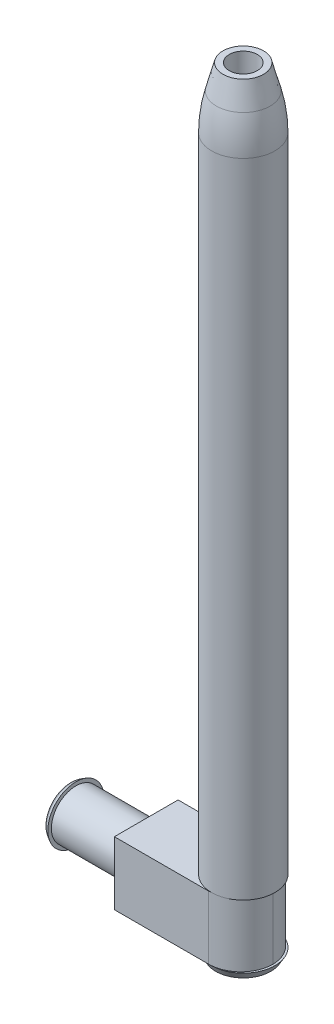
ISO-10303-21;
HEADER;
FILE_DESCRIPTION(('STEP AP214'),'2;1');
FILE_NAME('part.step','',(''),(''),'','','');
FILE_SCHEMA(('AUTOMOTIVE_DESIGN { 1 0 10303 214 1 1 1 1 }'));
ENDSEC;
DATA;
#1=APPLICATION_CONTEXT('core data for automotive mechanical design processes');
#2=APPLICATION_PROTOCOL_DEFINITION('international standard','automotive_design',2000,#1);
#3=PRODUCT_CONTEXT('',#1,'mechanical');
#4=PRODUCT('Part','Part','',(#3));
#5=PRODUCT_RELATED_PRODUCT_CATEGORY('part','',(#4));
#6=PRODUCT_DEFINITION_FORMATION('','',#4);
#7=PRODUCT_DEFINITION_CONTEXT('part definition',#1,'design');
#8=PRODUCT_DEFINITION('design','',#6,#7);
#9=PRODUCT_DEFINITION_SHAPE('','',#8);
#10=(LENGTH_UNIT() NAMED_UNIT(*) SI_UNIT(.MILLI.,.METRE.));
#11=(NAMED_UNIT(*) PLANE_ANGLE_UNIT() SI_UNIT($,.RADIAN.));
#12=(NAMED_UNIT(*) SI_UNIT($,.STERADIAN.) SOLID_ANGLE_UNIT());
#13=UNCERTAINTY_MEASURE_WITH_UNIT(LENGTH_MEASURE(1.E-05),#10,'distance_accuracy_value','');
#14=(GEOMETRIC_REPRESENTATION_CONTEXT(3) GLOBAL_UNCERTAINTY_ASSIGNED_CONTEXT((#13)) GLOBAL_UNIT_ASSIGNED_CONTEXT((#10,
#11,#12)) REPRESENTATION_CONTEXT('',''));
#15=CARTESIAN_POINT('',(0.,0.,0.));
#16=DIRECTION('',(0.,0.,1.));
#17=DIRECTION('',(1.,0.,0.));
#18=AXIS2_PLACEMENT_3D('',#15,#16,#17);
#19=CARTESIAN_POINT('',(29.21,5.715,5.7531));
#20=DIRECTION('',(0.,-1.,0.));
#21=DIRECTION('',(0.,0.,-1.));
#22=AXIS2_PLACEMENT_3D('',#19,#20,#21);
#23=PLANE('',#22);
#24=CARTESIAN_POINT('',(23.876,5.715,0.));
#25=DIRECTION('',(0.,1.,0.));
#26=DIRECTION('',(0.,0.,1.));
#27=AXIS2_PLACEMENT_3D('',#24,#25,#26);
#28=CIRCLE('',#27,5.715);
#29=CARTESIAN_POINT('',(24.0592354385687,5.715,-5.71206177960747));
#30=VERTEX_POINT('',#29);
#31=CARTESIAN_POINT('',(24.0592354385687,5.715,5.71206177960747));
#32=VERTEX_POINT('',#31);
#33=EDGE_CURVE('E49',#30,#32,#28,.T.);
#34=ORIENTED_EDGE('',*,*,#33,.F.);
#35=CARTESIAN_POINT('',(23.368,5.715,0.0889000000000003));
#36=DIRECTION('',(0.,-1.,0.));
#37=DIRECTION('',(0.,0.,-1.));
#38=AXIS2_PLACEMENT_3D('',#35,#36,#37);
#39=CIRCLE('',#38,5.842);
#40=CARTESIAN_POINT('',(23.368,5.715,-5.7531));
#41=VERTEX_POINT('',#40);
#42=EDGE_CURVE('E98',#30,#41,#39,.F.);
#43=ORIENTED_EDGE('',*,*,#42,.T.);
#44=DIRECTION('',(-1.,0.,0.));
#45=VECTOR('',#44,1.);
#46=CARTESIAN_POINT('',(29.21,5.715,-5.7531));
#47=LINE('',#46,#45);
#48=CARTESIAN_POINT('',(6.35,5.715,-5.7531));
#49=VERTEX_POINT('',#48);
#50=EDGE_CURVE('E147',#41,#49,#47,.T.);
#51=ORIENTED_EDGE('',*,*,#50,.T.);
#52=DIRECTION('',(0.,0.,1.));
#53=VECTOR('',#52,1.);
#54=CARTESIAN_POINT('',(6.35,5.715,5.7531));
#55=LINE('',#54,#53);
#56=CARTESIAN_POINT('',(6.35,5.715,5.7531));
#57=VERTEX_POINT('',#56);
#58=EDGE_CURVE('E134',#49,#57,#55,.T.);
#59=ORIENTED_EDGE('',*,*,#58,.T.);
#60=DIRECTION('',(-1.,0.,0.));
#61=VECTOR('',#60,1.);
#62=CARTESIAN_POINT('',(29.21,5.715,5.7531));
#63=LINE('',#62,#61);
#64=CARTESIAN_POINT('',(23.368,5.715,5.7531));
#65=VERTEX_POINT('',#64);
#66=EDGE_CURVE('E95',#65,#57,#63,.T.);
#67=ORIENTED_EDGE('',*,*,#66,.F.);
#68=CARTESIAN_POINT('',(23.368,5.715,-0.0889000000000003));
#69=DIRECTION('',(0.,-1.,0.));
#70=DIRECTION('',(0.,0.,-1.));
#71=AXIS2_PLACEMENT_3D('',#68,#69,#70);
#72=CIRCLE('',#71,5.842);
#73=EDGE_CURVE('E92',#65,#32,#72,.F.);
#74=ORIENTED_EDGE('',*,*,#73,.T.);
#75=EDGE_LOOP('',(#34,#43,#51,#59,#67,#74));
#76=FACE_BOUND('',#75,.T.);
#77=ADVANCED_FACE('F34',(#76),#23,.F.);
#78=CARTESIAN_POINT('',(29.21,-5.715,5.7531));
#79=DIRECTION('',(0.,1.,0.));
#80=DIRECTION('',(0.,0.,1.));
#81=AXIS2_PLACEMENT_3D('',#78,#79,#80);
#82=PLANE('',#81);
#83=CARTESIAN_POINT('',(23.876,-5.715,0.));
#84=DIRECTION('',(0.,-1.,0.));
#85=DIRECTION('',(0.,0.,-1.));
#86=AXIS2_PLACEMENT_3D('',#83,#84,#85);
#87=CIRCLE('',#86,5.715);
#88=CARTESIAN_POINT('',(24.0592354385687,-5.715,5.71206177960747));
#89=VERTEX_POINT('',#88);
#90=CARTESIAN_POINT('',(24.0592354385687,-5.715,-5.71206177960747));
#91=VERTEX_POINT('',#90);
#92=EDGE_CURVE('E57',#89,#91,#87,.T.);
#93=ORIENTED_EDGE('',*,*,#92,.F.);
#94=CARTESIAN_POINT('',(23.368,-5.715,-0.0889000000000003));
#95=DIRECTION('',(0.,1.,0.));
#96=DIRECTION('',(0.,0.,1.));
#97=AXIS2_PLACEMENT_3D('',#94,#95,#96);
#98=CIRCLE('',#97,5.842);
#99=CARTESIAN_POINT('',(23.368,-5.715,5.7531));
#100=VERTEX_POINT('',#99);
#101=EDGE_CURVE('E167',#89,#100,#98,.F.);
#102=ORIENTED_EDGE('',*,*,#101,.T.);
#103=DIRECTION('',(-1.,0.,0.));
#104=VECTOR('',#103,1.);
#105=CARTESIAN_POINT('',(29.21,-5.715,5.7531));
#106=LINE('',#105,#104);
#107=CARTESIAN_POINT('',(6.35,-5.715,5.7531));
#108=VERTEX_POINT('',#107);
#109=EDGE_CURVE('E144',#100,#108,#106,.T.);
#110=ORIENTED_EDGE('',*,*,#109,.T.);
#111=DIRECTION('',(0.,0.,-1.));
#112=VECTOR('',#111,1.);
#113=CARTESIAN_POINT('',(6.35,-5.715,5.7531));
#114=LINE('',#113,#112);
#115=CARTESIAN_POINT('',(6.35,-5.715,-5.7531));
#116=VERTEX_POINT('',#115);
#117=EDGE_CURVE('E139',#108,#116,#114,.T.);
#118=ORIENTED_EDGE('',*,*,#117,.T.);
#119=DIRECTION('',(-1.,0.,0.));
#120=VECTOR('',#119,1.);
#121=CARTESIAN_POINT('',(29.21,-5.715,-5.7531));
#122=LINE('',#121,#120);
#123=CARTESIAN_POINT('',(23.368,-5.715,-5.7531));
#124=VERTEX_POINT('',#123);
#125=EDGE_CURVE('E142',#124,#116,#122,.T.);
#126=ORIENTED_EDGE('',*,*,#125,.F.);
#127=CARTESIAN_POINT('',(23.368,-5.715,0.0889000000000003));
#128=DIRECTION('',(0.,1.,0.));
#129=DIRECTION('',(0.,0.,1.));
#130=AXIS2_PLACEMENT_3D('',#127,#128,#129);
#131=CIRCLE('',#130,5.842);
#132=EDGE_CURVE('E172',#124,#91,#131,.F.);
#133=ORIENTED_EDGE('',*,*,#132,.T.);
#134=EDGE_LOOP('',(#93,#102,#110,#118,#126,#133));
#135=FACE_BOUND('',#134,.T.);
#136=ADVANCED_FACE('F192',(#135),#82,.F.);
#137=CARTESIAN_POINT('',(6.35,0.,0.));
#138=DIRECTION('',(-1.,0.,0.));
#139=DIRECTION('',(0.,0.,1.));
#140=AXIS2_PLACEMENT_3D('',#137,#138,#139);
#141=CYLINDRICAL_SURFACE('',#140,4.445);
#142=CARTESIAN_POINT('',(6.35,0.,0.));
#143=DIRECTION('',(1.,0.,0.));
#144=DIRECTION('',(0.,0.,-1.));
#145=AXIS2_PLACEMENT_3D('',#142,#143,#144);
#146=CIRCLE('',#145,4.445);
#147=CARTESIAN_POINT('',(6.35,0.,4.445));
#148=VERTEX_POINT('',#147);
#149=EDGE_CURVE('E155',#148,#148,#146,.T.);
#150=CARTESIAN_POINT('',(-6.35,0.,0.));
#151=DIRECTION('',(-1.,0.,0.));
#152=DIRECTION('',(0.,0.,1.));
#153=AXIS2_PLACEMENT_3D('',#150,#151,#152);
#154=CIRCLE('',#153,4.445);
#155=CARTESIAN_POINT('',(-6.35,0.,4.445));
#156=VERTEX_POINT('',#155);
#157=EDGE_CURVE('E152',#156,#156,#154,.T.);
#158=CARTESIAN_POINT('',(6.35,0.,4.445));
#159=CARTESIAN_POINT('',(6.21770833333333,0.,4.445));
#160=CARTESIAN_POINT('',(6.08541666666667,0.,4.445));
#161=CARTESIAN_POINT('',(5.82083333333333,0.,4.445));
#162=CARTESIAN_POINT('',(5.68854166666667,0.,4.445));
#163=CARTESIAN_POINT('',(5.42395833333333,0.,4.445));
#164=CARTESIAN_POINT('',(5.29166666666667,0.,4.445));
#165=CARTESIAN_POINT('',(5.02708333333333,0.,4.445));
#166=CARTESIAN_POINT('',(4.89479166666667,0.,4.445));
#167=CARTESIAN_POINT('',(4.63020833333333,0.,4.445));
#168=CARTESIAN_POINT('',(4.49791666666667,0.,4.445));
#169=CARTESIAN_POINT('',(4.23333333333333,0.,4.445));
#170=CARTESIAN_POINT('',(4.10104166666667,0.,4.445));
#171=CARTESIAN_POINT('',(3.83645833333333,0.,4.445));
#172=CARTESIAN_POINT('',(3.70416666666667,0.,4.445));
#173=CARTESIAN_POINT('',(3.43958333333333,0.,4.445));
#174=CARTESIAN_POINT('',(3.30729166666667,0.,4.445));
#175=CARTESIAN_POINT('',(3.04270833333333,0.,4.445));
#176=CARTESIAN_POINT('',(2.91041666666667,0.,4.445));
#177=CARTESIAN_POINT('',(2.64583333333333,0.,4.445));
#178=CARTESIAN_POINT('',(2.51354166666667,0.,4.445));
#179=CARTESIAN_POINT('',(2.24895833333333,0.,4.445));
#180=CARTESIAN_POINT('',(2.11666666666667,0.,4.445));
#181=CARTESIAN_POINT('',(1.85208333333333,0.,4.445));
#182=CARTESIAN_POINT('',(1.71979166666667,0.,4.445));
#183=CARTESIAN_POINT('',(1.45520833333333,0.,4.445));
#184=CARTESIAN_POINT('',(1.32291666666667,0.,4.445));
#185=CARTESIAN_POINT('',(1.05833333333333,0.,4.445));
#186=CARTESIAN_POINT('',(0.926041666666666,0.,4.445));
#187=CARTESIAN_POINT('',(0.661458333333332,0.,4.445));
#188=CARTESIAN_POINT('',(0.529166666666666,0.,4.445));
#189=CARTESIAN_POINT('',(0.264583333333332,0.,4.445));
#190=CARTESIAN_POINT('',(0.132291666666666,0.,4.445));
#191=CARTESIAN_POINT('',(-0.132291666666667,0.,4.445));
#192=CARTESIAN_POINT('',(-0.264583333333334,0.,4.445));
#193=CARTESIAN_POINT('',(-0.529166666666667,0.,4.445));
#194=CARTESIAN_POINT('',(-0.661458333333334,0.,4.445));
#195=CARTESIAN_POINT('',(-0.926041666666668,0.,4.445));
#196=CARTESIAN_POINT('',(-1.05833333333333,0.,4.445));
#197=CARTESIAN_POINT('',(-1.32291666666667,0.,4.445));
#198=CARTESIAN_POINT('',(-1.45520833333333,0.,4.445));
#199=CARTESIAN_POINT('',(-1.71979166666667,0.,4.445));
#200=CARTESIAN_POINT('',(-1.85208333333333,0.,4.445));
#201=CARTESIAN_POINT('',(-2.11666666666667,0.,4.445));
#202=CARTESIAN_POINT('',(-2.24895833333333,0.,4.445));
#203=CARTESIAN_POINT('',(-2.51354166666667,0.,4.445));
#204=CARTESIAN_POINT('',(-2.64583333333333,0.,4.445));
#205=CARTESIAN_POINT('',(-2.91041666666667,0.,4.445));
#206=CARTESIAN_POINT('',(-3.04270833333333,0.,4.445));
#207=CARTESIAN_POINT('',(-3.30729166666667,0.,4.445));
#208=CARTESIAN_POINT('',(-3.43958333333333,0.,4.445));
#209=CARTESIAN_POINT('',(-3.70416666666667,0.,4.445));
#210=CARTESIAN_POINT('',(-3.83645833333333,0.,4.445));
#211=CARTESIAN_POINT('',(-4.10104166666667,0.,4.445));
#212=CARTESIAN_POINT('',(-4.23333333333333,0.,4.445));
#213=CARTESIAN_POINT('',(-4.49791666666667,0.,4.445));
#214=CARTESIAN_POINT('',(-4.63020833333333,0.,4.445));
#215=CARTESIAN_POINT('',(-4.89479166666667,0.,4.445));
#216=CARTESIAN_POINT('',(-5.02708333333333,0.,4.445));
#217=CARTESIAN_POINT('',(-5.29166666666667,0.,4.445));
#218=CARTESIAN_POINT('',(-5.42395833333333,0.,4.445));
#219=CARTESIAN_POINT('',(-5.68854166666667,0.,4.445));
#220=CARTESIAN_POINT('',(-5.82083333333333,0.,4.445));
#221=CARTESIAN_POINT('',(-6.08541666666667,0.,4.445));
#222=CARTESIAN_POINT('',(-6.21770833333333,0.,4.445));
#223=CARTESIAN_POINT('',(-6.35,0.,4.445));
#224=B_SPLINE_CURVE_WITH_KNOTS('',3,(#158,#159,#160,#161,#162,#163,#164,#165,#166,#167,#168,
#169,#170,#171,#172,#173,#174,#175,#176,#177,#178,#179,#180,#181,#182,#183,#184,#185,#186,#187,
#188,#189,#190,#191,#192,#193,#194,#195,#196,#197,#198,#199,#200,#201,#202,#203,#204,#205,#206,
#207,#208,#209,#210,#211,#212,#213,#214,#215,#216,#217,#218,#219,#220,#221,#222,#223),
.UNSPECIFIED.,.F.,.F.,(4,2,2,2,2,2,2,2,2,2,2,2,2,2,2,2,2,2,2,2,2,2,2,2,2,2,2,2,2,2,2,2,4),(0.,
0.396875,0.793749999999999,1.190625,1.5875,1.984375,2.38125,2.778125,3.175,3.571875,3.96875,
4.365625,4.7625,5.159375,5.55625,5.953125,6.35,6.746875,7.14375,7.540625,7.9375,8.334375,
8.73125,9.128125,9.525,9.921875,10.31875,10.715625,11.1125,11.509375,11.90625,12.303125,12.7),.UNSPECIFIED.);
#225=EDGE_CURVE('BSEAM197',#148,#156,#224,.T.);
#226=ORIENTED_EDGE('',*,*,#149,.F.);
#227=ORIENTED_EDGE('',*,*,#157,.F.);
#228=ORIENTED_EDGE('',*,*,#225,.T.);
#229=ORIENTED_EDGE('',*,*,#225,.F.);
#230=EDGE_LOOP('',(#226,#228,#227,#229));
#231=FACE_BOUND('',#230,.T.);
#232=ADVANCED_FACE('F197',(#231),#141,.T.);
#233=CARTESIAN_POINT('',(-6.35,0.,0.));
#234=DIRECTION('',(-1.,0.,0.));
#235=DIRECTION('',(0.,0.,1.));
#236=AXIS2_PLACEMENT_3D('',#233,#234,#235);
#237=PLANE('',#236);
#238=CARTESIAN_POINT('',(-6.35,0.,0.));
#239=DIRECTION('',(-1.,0.,0.));
#240=DIRECTION('',(0.,0.,1.));
#241=AXIS2_PLACEMENT_3D('',#238,#239,#240);
#242=CIRCLE('',#241,5.08);
#243=CARTESIAN_POINT('',(-6.35,0.,5.08));
#244=VERTEX_POINT('',#243);
#245=EDGE_CURVE('E149',#244,#244,#242,.T.);
#246=ORIENTED_EDGE('',*,*,#245,.F.);
#247=EDGE_LOOP('',(#246));
#248=FACE_BOUND('',#247,.T.);
#249=ORIENTED_EDGE('',*,*,#157,.T.);
#250=EDGE_LOOP('',(#249));
#251=FACE_BOUND('',#250,.T.);
#252=ADVANCED_FACE('F213',(#248,#251),#237,.F.);
#253=CARTESIAN_POINT('',(-6.35,0.,0.));
#254=DIRECTION('',(1.,0.,0.));
#255=DIRECTION('',(0.,0.,1.));
#256=AXIS2_PLACEMENT_3D('',#253,#254,#255);
#257=CONICAL_SURFACE('',#256,5.08,0.5235987755983);
#258=CARTESIAN_POINT('',(-6.985,0.,0.));
#259=DIRECTION('',(1.,0.,0.));
#260=DIRECTION('',(0.,0.,-1.));
#261=AXIS2_PLACEMENT_3D('',#258,#259,#260);
#262=CIRCLE('',#261,4.71338257906459);
#263=CARTESIAN_POINT('',(-6.985,0.,-4.71338257906459));
#264=VERTEX_POINT('',#263);
#265=EDGE_CURVE('E109',#264,#264,#262,.T.);
#266=ORIENTED_EDGE('',*,*,#265,.T.);
#267=EDGE_LOOP('',(#266));
#268=FACE_BOUND('',#267,.T.);
#269=ORIENTED_EDGE('',*,*,#245,.T.);
#270=EDGE_LOOP('',(#269));
#271=FACE_BOUND('',#270,.T.);
#272=ADVANCED_FACE('F211',(#268,#271),#257,.T.);
#273=CARTESIAN_POINT('',(-7.62,0.,0.));
#274=DIRECTION('',(-1.,0.,0.));
#275=DIRECTION('',(0.,0.,1.));
#276=AXIS2_PLACEMENT_3D('',#273,#274,#275);
#277=PLANE('',#276);
#278=CARTESIAN_POINT('',(-7.62,0.,0.));
#279=DIRECTION('',(-1.,0.,0.));
#280=DIRECTION('',(0.,0.,1.));
#281=AXIS2_PLACEMENT_3D('',#278,#279,#280);
#282=CIRCLE('',#281,3.61353031625835);
#283=CARTESIAN_POINT('',(-7.62,0.,3.61353031625835));
#284=VERTEX_POINT('',#283);
#285=EDGE_CURVE('E158',#284,#284,#282,.T.);
#286=ORIENTED_EDGE('',*,*,#285,.T.);
#287=EDGE_LOOP('',(#286));
#288=FACE_BOUND('',#287,.T.);
#289=ADVANCED_FACE('F207',(#288),#277,.T.);
#290=CARTESIAN_POINT('',(-6.35,0.,0.));
#291=DIRECTION('',(-1.,0.,0.));
#292=DIRECTION('',(0.,0.,1.));
#293=AXIS2_PLACEMENT_3D('',#290,#291,#292);
#294=TOROIDAL_SURFACE('',#293,3.61353031625835,1.27);
#295=ORIENTED_EDGE('',*,*,#265,.F.);
#296=EDGE_LOOP('',(#295));
#297=FACE_BOUND('',#296,.T.);
#298=ORIENTED_EDGE('',*,*,#285,.F.);
#299=EDGE_LOOP('',(#298));
#300=FACE_BOUND('',#299,.T.);
#301=ADVANCED_FACE('F210',(#297,#300),#294,.T.);
#302=CARTESIAN_POINT('',(6.35,0.,0.));
#303=DIRECTION('',(-1.,0.,0.));
#304=DIRECTION('',(0.,0.,1.));
#305=AXIS2_PLACEMENT_3D('',#302,#303,#304);
#306=PLANE('',#305);
#307=DIRECTION('',(0.,1.,0.));
#308=VECTOR('',#307,1.);
#309=CARTESIAN_POINT('',(6.35,-5.715,-5.7531));
#310=LINE('',#309,#308);
#311=EDGE_CURVE('E131',#116,#49,#310,.T.);
#312=ORIENTED_EDGE('',*,*,#311,.F.);
#313=ORIENTED_EDGE('',*,*,#117,.F.);
#314=DIRECTION('',(0.,-1.,0.));
#315=VECTOR('',#314,1.);
#316=CARTESIAN_POINT('',(6.35,-5.715,5.7531));
#317=LINE('',#316,#315);
#318=EDGE_CURVE('E136',#57,#108,#317,.T.);
#319=ORIENTED_EDGE('',*,*,#318,.F.);
#320=ORIENTED_EDGE('',*,*,#58,.F.);
#321=EDGE_LOOP('',(#312,#313,#319,#320));
#322=FACE_BOUND('',#321,.T.);
#323=ORIENTED_EDGE('',*,*,#149,.T.);
#324=EDGE_LOOP('',(#323));
#325=FACE_BOUND('',#324,.T.);
#326=ADVANCED_FACE('F205',(#322,#325),#306,.T.);
#327=CARTESIAN_POINT('',(29.21,-5.715,-5.7531));
#328=DIRECTION('',(0.,0.,1.));
#329=DIRECTION('',(1.,0.,0.));
#330=AXIS2_PLACEMENT_3D('',#327,#328,#329);
#331=PLANE('',#330);
#332=ORIENTED_EDGE('',*,*,#50,.F.);
#333=DIRECTION('',(0.,1.,0.));
#334=VECTOR('',#333,1.);
#335=CARTESIAN_POINT('',(23.368,-5.715,-5.7531));
#336=LINE('',#335,#334);
#337=EDGE_CURVE('E164',#41,#124,#336,.F.);
#338=ORIENTED_EDGE('',*,*,#337,.T.);
#339=ORIENTED_EDGE('',*,*,#125,.T.);
#340=ORIENTED_EDGE('',*,*,#311,.T.);
#341=EDGE_LOOP('',(#332,#338,#339,#340));
#342=FACE_BOUND('',#341,.T.);
#343=ADVANCED_FACE('F202',(#342),#331,.F.);
#344=CARTESIAN_POINT('',(29.21,-5.715,5.7531));
#345=DIRECTION('',(0.,0.,-1.));
#346=DIRECTION('',(-1.,0.,0.));
#347=AXIS2_PLACEMENT_3D('',#344,#345,#346);
#348=PLANE('',#347);
#349=ORIENTED_EDGE('',*,*,#109,.F.);
#350=DIRECTION('',(0.,-1.,0.));
#351=VECTOR('',#350,1.);
#352=CARTESIAN_POINT('',(23.368,-5.715,5.7531));
#353=LINE('',#352,#351);
#354=EDGE_CURVE('E174',#100,#65,#353,.F.);
#355=ORIENTED_EDGE('',*,*,#354,.T.);
#356=ORIENTED_EDGE('',*,*,#66,.T.);
#357=ORIENTED_EDGE('',*,*,#318,.T.);
#358=EDGE_LOOP('',(#349,#355,#356,#357));
#359=FACE_BOUND('',#358,.T.);
#360=ADVANCED_FACE('F201',(#359),#348,.F.);
#361=CARTESIAN_POINT('',(23.368,0.,-0.0889000000000003));
#362=DIRECTION('',(0.,-1.,0.));
#363=DIRECTION('',(0.,0.,-1.));
#364=AXIS2_PLACEMENT_3D('',#361,#362,#363);
#365=CYLINDRICAL_SURFACE('',#364,5.842);
#366=ORIENTED_EDGE('',*,*,#354,.F.);
#367=ORIENTED_EDGE('',*,*,#101,.F.);
#368=CARTESIAN_POINT('',(29.2093235477929,-5.715,0.));
#369=VERTEX_POINT('',#368);
#370=EDGE_CURVE('E168',#369,#89,#98,.F.);
#371=ORIENTED_EDGE('',*,*,#370,.F.);
#372=DIRECTION('',(0.,-1.,0.));
#373=VECTOR('',#372,1.);
#374=CARTESIAN_POINT('',(29.2093235477929,0.,0.));
#375=LINE('',#374,#373);
#376=CARTESIAN_POINT('',(29.2093235477929,5.715,0.));
#377=VERTEX_POINT('',#376);
#378=EDGE_CURVE('E104',#377,#369,#375,.T.);
#379=ORIENTED_EDGE('',*,*,#378,.F.);
#380=EDGE_CURVE('E99',#32,#377,#72,.F.);
#381=ORIENTED_EDGE('',*,*,#380,.F.);
#382=ORIENTED_EDGE('',*,*,#73,.F.);
#383=EDGE_LOOP('',(#366,#367,#371,#379,#381,#382));
#384=FACE_BOUND('',#383,.T.);
#385=ADVANCED_FACE('F102',(#384),#365,.T.);
#386=CARTESIAN_POINT('',(23.368,0.,0.0889000000000003));
#387=DIRECTION('',(0.,1.,0.));
#388=DIRECTION('',(0.,0.,1.));
#389=AXIS2_PLACEMENT_3D('',#386,#387,#388);
#390=CYLINDRICAL_SURFACE('',#389,5.842);
#391=ORIENTED_EDGE('',*,*,#132,.F.);
#392=ORIENTED_EDGE('',*,*,#337,.F.);
#393=ORIENTED_EDGE('',*,*,#42,.F.);
#394=EDGE_CURVE('E117',#377,#30,#39,.F.);
#395=ORIENTED_EDGE('',*,*,#394,.F.);
#396=ORIENTED_EDGE('',*,*,#378,.T.);
#397=EDGE_CURVE('E171',#91,#369,#131,.F.);
#398=ORIENTED_EDGE('',*,*,#397,.F.);
#399=EDGE_LOOP('',(#391,#392,#393,#395,#396,#398));
#400=FACE_BOUND('',#399,.T.);
#401=ADVANCED_FACE('F226',(#400),#390,.T.);
#402=CARTESIAN_POINT('',(23.876,-6.985,0.));
#403=DIRECTION('',(0.,-1.,0.));
#404=DIRECTION('',(0.,0.,-1.));
#405=AXIS2_PLACEMENT_3D('',#402,#403,#404);
#406=PLANE('',#405);
#407=CARTESIAN_POINT('',(23.876,-6.985,0.));
#408=DIRECTION('',(0.,-1.,0.));
#409=DIRECTION('',(0.,0.,-1.));
#410=AXIS2_PLACEMENT_3D('',#407,#408,#409);
#411=CIRCLE('',#410,4.98176515812917);
#412=CARTESIAN_POINT('',(23.876,-6.985,-4.98176515812917));
#413=VERTEX_POINT('',#412);
#414=EDGE_CURVE('E121',#413,#413,#411,.T.);
#415=ORIENTED_EDGE('',*,*,#414,.T.);
#416=EDGE_LOOP('',(#415));
#417=FACE_BOUND('',#416,.T.);
#418=ADVANCED_FACE('F229',(#417),#406,.T.);
#419=CARTESIAN_POINT('',(23.876,-5.715,0.));
#420=DIRECTION('',(0.,1.,0.));
#421=DIRECTION('',(0.,0.,-1.));
#422=AXIS2_PLACEMENT_3D('',#419,#420,#421);
#423=CONICAL_SURFACE('',#422,5.715,0.5235987755983);
#424=ORIENTED_EDGE('',*,*,#414,.F.);
#425=EDGE_LOOP('',(#424));
#426=FACE_BOUND('',#425,.T.);
#427=EDGE_CURVE('E118',#91,#89,#87,.T.);
#428=ORIENTED_EDGE('',*,*,#427,.T.);
#429=ORIENTED_EDGE('',*,*,#92,.T.);
#430=EDGE_LOOP('',(#428,#429));
#431=FACE_BOUND('',#430,.T.);
#432=ADVANCED_FACE('F247',(#426,#431),#423,.T.);
#433=CARTESIAN_POINT('',(23.876,-5.715,0.));
#434=DIRECTION('',(0.,-1.,0.));
#435=DIRECTION('',(0.,0.,-1.));
#436=AXIS2_PLACEMENT_3D('',#433,#434,#435);
#437=PLANE('',#436);
#438=ORIENTED_EDGE('',*,*,#427,.F.);
#439=ORIENTED_EDGE('',*,*,#397,.T.);
#440=ORIENTED_EDGE('',*,*,#370,.T.);
#441=EDGE_LOOP('',(#438,#439,#440));
#442=FACE_BOUND('',#441,.T.);
#443=ADVANCED_FACE('F244',(#442),#437,.F.);
#444=CARTESIAN_POINT('',(23.876,5.715,0.));
#445=DIRECTION('',(0.,1.,0.));
#446=DIRECTION('',(0.,0.,1.));
#447=AXIS2_PLACEMENT_3D('',#444,#445,#446);
#448=PLANE('',#447);
#449=EDGE_CURVE('E113',#32,#30,#28,.T.);
#450=ORIENTED_EDGE('',*,*,#449,.F.);
#451=ORIENTED_EDGE('',*,*,#380,.T.);
#452=ORIENTED_EDGE('',*,*,#394,.T.);
#453=EDGE_LOOP('',(#450,#451,#452));
#454=FACE_BOUND('',#453,.T.);
#455=ADVANCED_FACE('F116',(#454),#448,.F.);
#456=CARTESIAN_POINT('',(23.876,132.715,0.));
#457=DIRECTION('',(0.,1.,0.));
#458=DIRECTION('',(0.,0.,1.));
#459=AXIS2_PLACEMENT_3D('',#456,#457,#458);
#460=PLANE('',#459);
#461=CARTESIAN_POINT('',(23.876,132.715,0.));
#462=DIRECTION('',(0.,1.,0.));
#463=DIRECTION('',(0.,0.,1.));
#464=AXIS2_PLACEMENT_3D('',#461,#462,#463);
#465=CIRCLE('',#464,3.67322715367487);
#466=CARTESIAN_POINT('',(23.876,132.715,3.67322715367487));
#467=VERTEX_POINT('',#466);
#468=EDGE_CURVE('E114',#467,#467,#465,.T.);
#469=ORIENTED_EDGE('',*,*,#468,.T.);
#470=EDGE_LOOP('',(#469));
#471=FACE_BOUND('',#470,.T.);
#472=CARTESIAN_POINT('',(23.876,132.715,0.));
#473=DIRECTION('',(0.,1.,0.));
#474=DIRECTION('',(0.,0.,1.));
#475=AXIS2_PLACEMENT_3D('',#472,#473,#474);
#476=CIRCLE('',#475,2.54);
#477=CARTESIAN_POINT('',(23.876,132.715,2.54));
#478=VERTEX_POINT('',#477);
#479=EDGE_CURVE('E119',#478,#478,#476,.T.);
#480=ORIENTED_EDGE('',*,*,#479,.F.);
#481=EDGE_LOOP('',(#480));
#482=FACE_BOUND('',#481,.T.);
#483=ADVANCED_FACE('F321',(#471,#482),#460,.T.);
#484=CARTESIAN_POINT('',(23.876,132.715,0.));
#485=DIRECTION('',(0.,-1.,0.));
#486=DIRECTION('',(0.,0.,-1.));
#487=AXIS2_PLACEMENT_3D('',#484,#485,#486);
#488=CYLINDRICAL_SURFACE('',#487,5.715);
#489=CARTESIAN_POINT('',(23.876,121.75102656128,0.));
#490=DIRECTION('',(0.,1.,0.));
#491=DIRECTION('',(0.,0.,1.));
#492=AXIS2_PLACEMENT_3D('',#489,#490,#491);
#493=CIRCLE('',#492,5.715);
#494=CARTESIAN_POINT('',(23.876,121.75102656128,5.715));
#495=VERTEX_POINT('',#494);
#496=EDGE_CURVE('E42',#495,#495,#493,.F.);
#497=ORIENTED_EDGE('',*,*,#496,.T.);
#498=EDGE_LOOP('',(#497));
#499=FACE_BOUND('',#498,.T.);
#500=ORIENTED_EDGE('',*,*,#449,.T.);
#501=ORIENTED_EDGE('',*,*,#33,.T.);
#502=EDGE_LOOP('',(#500,#501));
#503=FACE_BOUND('',#502,.T.);
#504=ADVANCED_FACE('F112',(#499,#503),#488,.T.);
#505=CARTESIAN_POINT('',(23.876,-5.715,0.));
#506=DIRECTION('',(0.,1.,0.));
#507=DIRECTION('',(0.,0.,1.));
#508=AXIS2_PLACEMENT_3D('',#505,#506,#507);
#509=CIRCLE('',#508,2.54);
#510=CARTESIAN_POINT('',(23.876,-5.715,2.54));
#511=VERTEX_POINT('',#510);
#512=EDGE_CURVE('E128',#511,#511,#509,.F.);
#513=ORIENTED_EDGE('',*,*,#512,.F.);
#514=EDGE_LOOP('',(#513));
#515=FACE_BOUND('',#514,.T.);
#516=ADVANCED_FACE('F256',(#515),#437,.F.);
#517=CARTESIAN_POINT('',(23.876,-5.716,0.));
#518=DIRECTION('',(0.,1.,0.));
#519=DIRECTION('',(0.,0.,1.));
#520=AXIS2_PLACEMENT_3D('',#517,#518,#519);
#521=CYLINDRICAL_SURFACE('',#520,2.54);
#522=ORIENTED_EDGE('',*,*,#512,.T.);
#523=EDGE_LOOP('',(#522));
#524=FACE_BOUND('',#523,.T.);
#525=ORIENTED_EDGE('',*,*,#479,.T.);
#526=EDGE_LOOP('',(#525));
#527=FACE_BOUND('',#526,.T.);
#528=ADVANCED_FACE('F188',(#524,#527),#521,.F.);
#529=CARTESIAN_POINT('',(23.876,132.715,0.));
#530=DIRECTION('',(0.,-1.,0.));
#531=DIRECTION('',(0.,0.,-1.));
#532=AXIS2_PLACEMENT_3D('',#529,#530,#531);
#533=CONICAL_SURFACE('',#532,3.67322715367487,0.261799387799147);
#534=CARTESIAN_POINT('',(23.876,128.325030306884,0.));
#535=DIRECTION('',(0.,-1.,0.));
#536=DIRECTION('',(0.,0.,-1.));
#537=AXIS2_PLACEMENT_3D('',#534,#535,#536);
#538=CIRCLE('',#537,4.84951598774235);
#539=CARTESIAN_POINT('',(23.876,128.325030306884,-4.84951598774235));
#540=VERTEX_POINT('',#539);
#541=EDGE_CURVE('E11',#540,#540,#538,.F.);
#542=ORIENTED_EDGE('',*,*,#541,.T.);
#543=EDGE_LOOP('',(#542));
#544=FACE_BOUND('',#543,.T.);
#545=ORIENTED_EDGE('',*,*,#468,.F.);
#546=EDGE_LOOP('',(#545));
#547=FACE_BOUND('',#546,.T.);
#548=ADVANCED_FACE('F183',(#544,#547),#533,.T.);
#549=CARTESIAN_POINT('',(23.876,121.75102656128,0.));
#550=DIRECTION('',(0.,1.,0.));
#551=DIRECTION('',(0.,0.,1.));
#552=AXIS2_PLACEMENT_3D('',#549,#550,#551);
#553=DEGENERATE_TOROIDAL_SURFACE('',#552,19.685,25.4,.F.);
#554=ORIENTED_EDGE('',*,*,#541,.F.);
#555=EDGE_LOOP('',(#554));
#556=FACE_BOUND('',#555,.T.);
#557=ORIENTED_EDGE('',*,*,#496,.F.);
#558=EDGE_LOOP('',(#557));
#559=FACE_BOUND('',#558,.T.);
#560=ADVANCED_FACE('F36',(#556,#559),#553,.F.);
#561=CLOSED_SHELL('',(#77,#136,#232,#252,#272,#289,#301,#326,#343,#360,#385,#401,#418,#432,#443,
#455,#483,#504,#516,#528,#548,#560));
#562=MANIFOLD_SOLID_BREP('B2',#561);
#563=ADVANCED_BREP_SHAPE_REPRESENTATION('',(#18,#562),#14);
#564=SHAPE_DEFINITION_REPRESENTATION(#9,#563);
ENDSEC;
END-ISO-10303-21;
